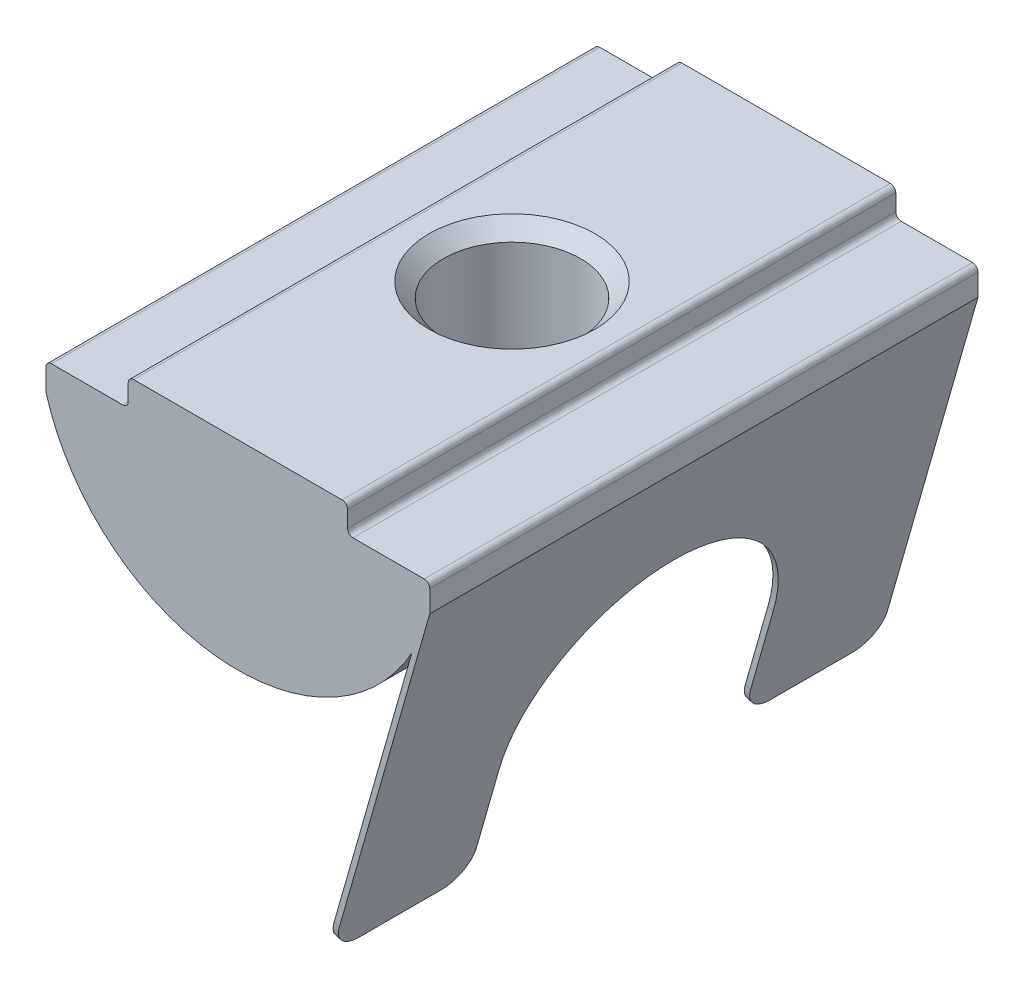
ISO-10303-21;
HEADER;
FILE_DESCRIPTION(('STEP AP214'),'2;1');
FILE_NAME('part.step','',(''),(''),'','','');
FILE_SCHEMA(('AUTOMOTIVE_DESIGN { 1 0 10303 214 1 1 1 1 }'));
ENDSEC;
DATA;
#1=APPLICATION_CONTEXT('core data for automotive mechanical design processes');
#2=APPLICATION_PROTOCOL_DEFINITION('international standard','automotive_design',2000,#1);
#3=PRODUCT_CONTEXT('',#1,'mechanical');
#4=PRODUCT('Part','Part','',(#3));
#5=PRODUCT_RELATED_PRODUCT_CATEGORY('part','',(#4));
#6=PRODUCT_DEFINITION_FORMATION('','',#4);
#7=PRODUCT_DEFINITION_CONTEXT('part definition',#1,'design');
#8=PRODUCT_DEFINITION('design','',#6,#7);
#9=PRODUCT_DEFINITION_SHAPE('','',#8);
#10=(LENGTH_UNIT() NAMED_UNIT(*) SI_UNIT(.MILLI.,.METRE.));
#11=(NAMED_UNIT(*) PLANE_ANGLE_UNIT() SI_UNIT($,.RADIAN.));
#12=(NAMED_UNIT(*) SI_UNIT($,.STERADIAN.) SOLID_ANGLE_UNIT());
#13=UNCERTAINTY_MEASURE_WITH_UNIT(LENGTH_MEASURE(1.E-05),#10,'distance_accuracy_value','');
#14=(GEOMETRIC_REPRESENTATION_CONTEXT(3) GLOBAL_UNCERTAINTY_ASSIGNED_CONTEXT((#13)) GLOBAL_UNIT_ASSIGNED_CONTEXT((#10,
#11,#12)) REPRESENTATION_CONTEXT('',''));
#15=CARTESIAN_POINT('',(0.,0.,0.));
#16=DIRECTION('',(0.,0.,1.));
#17=DIRECTION('',(1.,0.,0.));
#18=AXIS2_PLACEMENT_3D('',#15,#16,#17);
#19=CARTESIAN_POINT('',(3.23632054780592,-14.4448670937512,10.));
#20=DIRECTION('',(0.274721127897363,0.961523947640827,0.));
#21=DIRECTION('',(-0.961523947640827,0.274721127897363,0.));
#22=AXIS2_PLACEMENT_3D('',#19,#20,#21);
#23=PLANE('',#22);
#24=DIRECTION('',(0.,0.,-1.));
#25=VECTOR('',#24,1.);
#26=CARTESIAN_POINT('',(3.23632054780592,-14.4448670937512,10.));
#27=LINE('',#26,#25);
#28=CARTESIAN_POINT('',(3.23632054780592,-14.4448670937512,9.));
#29=VERTEX_POINT('',#28);
#30=CARTESIAN_POINT('',(3.23632054780592,-14.4448670937512,6.));
#31=VERTEX_POINT('',#30);
#32=EDGE_CURVE('E408',#29,#31,#27,.T.);
#33=ORIENTED_EDGE('',*,*,#32,.T.);
#34=DIRECTION('',(0.961523947640827,-0.274721127897363,0.));
#35=VECTOR('',#34,1.);
#36=CARTESIAN_POINT('',(3.23632054780592,-14.4448670937512,6.));
#37=LINE('',#36,#35);
#38=CARTESIAN_POINT('',(3.42862533733408,-14.4998113193307,6.));
#39=VERTEX_POINT('',#38);
#40=EDGE_CURVE('E364',#31,#39,#37,.T.);
#41=ORIENTED_EDGE('',*,*,#40,.T.);
#42=DIRECTION('',(0.,0.,-1.));
#43=VECTOR('',#42,1.);
#44=CARTESIAN_POINT('',(3.42862533733408,-14.4998113193307,10.));
#45=LINE('',#44,#43);
#46=CARTESIAN_POINT('',(3.42862533733408,-14.4998113193307,9.));
#47=VERTEX_POINT('',#46);
#48=EDGE_CURVE('E339',#47,#39,#45,.T.);
#49=ORIENTED_EDGE('',*,*,#48,.F.);
#50=DIRECTION('',(0.961523947640827,-0.274721127897363,0.));
#51=VECTOR('',#50,1.);
#52=CARTESIAN_POINT('',(3.23632054780592,-14.4448670937512,9.));
#53=LINE('',#52,#51);
#54=EDGE_CURVE('E362',#47,#29,#53,.F.);
#55=ORIENTED_EDGE('',*,*,#54,.T.);
#56=EDGE_LOOP('',(#33,#41,#49,#55));
#57=FACE_BOUND('',#56,.T.);
#58=ADVANCED_FACE('F37',(#57),#23,.F.);
#59=CARTESIAN_POINT('',(0.,0.,10.));
#60=DIRECTION('',(0.,0.,-1.));
#61=DIRECTION('',(-1.,0.,0.));
#62=AXIS2_PLACEMENT_3D('',#59,#60,#61);
#63=CYLINDRICAL_SURFACE('',#62,7.28010988928052);
#64=CARTESIAN_POINT('',(0.,-7.28010988928052,2.5));
#65=CARTESIAN_POINT('',(0.136172002973596,-7.28011090721013,2.50000149726712));
#66=CARTESIAN_POINT('',(0.272333456245304,-7.27625452620177,2.48883840329551));
#67=CARTESIAN_POINT('',(0.540631700282913,-7.26125171305419,2.44462768603801));
#68=CARTESIAN_POINT('',(0.672768314267703,-7.25010496118531,2.41157910293182));
#69=CARTESIAN_POINT('',(0.929110265104461,-7.22172923500482,2.32487368836761));
#70=CARTESIAN_POINT('',(1.05332891173866,-7.20451080331503,2.27125256413121));
#71=CARTESIAN_POINT('',(1.29100805538926,-7.16573916649586,2.1450902881722));
#72=CARTESIAN_POINT('',(1.40446622533751,-7.14418502685445,2.07254505657347));
#73=CARTESIAN_POINT('',(1.62154369249124,-7.09812088144492,1.90781716695809));
#74=CARTESIAN_POINT('',(1.72471659510491,-7.07353696810219,1.81506705800555));
#75=CARTESIAN_POINT('',(1.91438900072752,-7.02458029881306,1.61376808900686));
#76=CARTESIAN_POINT('',(2.00088452396937,-7.00020759459,1.50521546878509));
#77=CARTESIAN_POINT('',(2.15736096271624,-6.95360914951797,1.27129533030878));
#78=CARTESIAN_POINT('',(2.22675004681145,-6.93147284455898,1.1455123677416));
#79=CARTESIAN_POINT('',(2.3431963166986,-6.89298339231084,0.883179389448171));
#80=CARTESIAN_POINT('',(2.39026079713456,-6.87662835641702,0.746632907770805));
#81=CARTESIAN_POINT('',(2.45902666162184,-6.85233416396837,0.471742033480053));
#82=CARTESIAN_POINT('',(2.48156840718877,-6.84411709080833,0.33363317622437));
#83=CARTESIAN_POINT('',(2.50327644929663,-6.83620899259231,0.055367808356121));
#84=CARTESIAN_POINT('',(2.50245050194682,-6.8365151385437,-0.0847880074008335));
#85=CARTESIAN_POINT('',(2.47809674095438,-6.84537623905281,-0.355886800083905));
#86=CARTESIAN_POINT('',(2.45568077995558,-6.85352718334113,-0.486945190886543));
#87=CARTESIAN_POINT('',(2.3906027224079,-6.87649598693466,-0.743313406426924));
#88=CARTESIAN_POINT('',(2.34793806176709,-6.89131469056559,-0.868622500927038));
#89=CARTESIAN_POINT('',(2.24287391373931,-6.92622653995014,-1.11240008806434));
#90=CARTESIAN_POINT('',(2.18015471461307,-6.94640416827135,-1.23071816553836));
#91=CARTESIAN_POINT('',(2.03698389740605,-6.98972664055986,-1.45549514204004));
#92=CARTESIAN_POINT('',(1.95652691007652,-7.01287238208906,-1.56195043546876));
#93=CARTESIAN_POINT('',(1.77488315359577,-7.06109659600814,-1.76620717458573));
#94=CARTESIAN_POINT('',(1.67279218109922,-7.08621095740278,-1.86319776756405));
#95=CARTESIAN_POINT('',(1.45348844221079,-7.1344208661539,-2.03890031738033));
#96=CARTESIAN_POINT('',(1.33627404413953,-7.15751619522353,-2.11761029933795));
#97=CARTESIAN_POINT('',(1.08825090515884,-7.19942220387474,-2.25522413641818));
#98=CARTESIAN_POINT('',(0.957305787037685,-7.21818251231304,-2.31389859861828));
#99=CARTESIAN_POINT('',(0.686603674720866,-7.24893750906168,-2.40813080567592));
#100=CARTESIAN_POINT('',(0.546849958632755,-7.26093469792176,-2.44369709513474));
#101=CARTESIAN_POINT('',(0.269352973257202,-7.27639154772063,-2.48923870288672));
#102=CARTESIAN_POINT('',(0.131809470218108,-7.28021615822202,-2.50030876998938));
#103=CARTESIAN_POINT('',(-0.143204820098718,-7.27999916127158,-2.49967824487058));
#104=CARTESIAN_POINT('',(-0.280675616023345,-7.27595897453731,-2.48798176525776));
#105=CARTESIAN_POINT('',(-0.547180073947,-7.2607074679308,-2.44300925946856));
#106=CARTESIAN_POINT('',(-0.676343168003689,-7.24972305694643,-2.41041560684431));
#107=CARTESIAN_POINT('',(-0.927307313384241,-7.22191489938522,-2.32543755128986));
#108=CARTESIAN_POINT('',(-1.04910741417951,-7.20509040076205,-2.27305059943778));
#109=CARTESIAN_POINT('',(-1.28557880503337,-7.16673102834509,-2.14840314911509));
#110=CARTESIAN_POINT('',(-1.39996673893285,-7.14508066202505,-2.07564166556157));
#111=CARTESIAN_POINT('',(-1.61525922158065,-7.09951173020316,-1.91289345581315));
#112=CARTESIAN_POINT('',(-1.71615941608667,-7.07559243646424,-1.82290118970669));
#113=CARTESIAN_POINT('',(-1.90669766963834,-7.0267098274581,-1.62310353054673));
#114=CARTESIAN_POINT('',(-1.99555492718474,-7.0017519746124,-1.51255033804574));
#115=CARTESIAN_POINT('',(-2.15356634580185,-6.95478028320132,-1.27757379215295));
#116=CARTESIAN_POINT('',(-2.22272004110768,-6.93276651423653,-1.15315011097875));
#117=CARTESIAN_POINT('',(-2.33911288913602,-6.89436913565234,-0.893720756387379));
#118=CARTESIAN_POINT('',(-2.38637074740113,-6.87798072342277,-0.758724231020516));
#119=CARTESIAN_POINT('',(-2.45724666416524,-6.8529832027846,-0.481989431069247));
#120=CARTESIAN_POINT('',(-2.48087624926812,-6.8443703014403,-0.340254479083618));
#121=CARTESIAN_POINT('',(-2.5028928364975,-6.83634776676673,-0.0623689276409462));
#122=CARTESIAN_POINT('',(-2.50258379138015,-6.83646271469208,0.0736657186451755));
#123=CARTESIAN_POINT('',(-2.47997178682332,-6.8446973205737,0.34363502483685));
#124=CARTESIAN_POINT('',(-2.45767029483372,-6.85281644444991,0.477569824249305));
#125=CARTESIAN_POINT('',(-2.39265272519977,-6.87578028279747,0.736668394410245));
#126=CARTESIAN_POINT('',(-2.35038401512852,-6.89047725797267,0.861958568502402));
#127=CARTESIAN_POINT('',(-2.24700077680345,-6.92487844061245,1.10376091286428));
#128=CARTESIAN_POINT('',(-2.18588191024345,-6.94458380055771,1.22027105474743));
#129=CARTESIAN_POINT('',(-2.04327052166701,-6.987906262972,1.44699452591958));
#130=CARTESIAN_POINT('',(-1.96097301358844,-7.01166119962184,1.55667497524559));
#131=CARTESIAN_POINT('',(-1.77967402768589,-7.05985469974412,1.76108928969529));
#132=CARTESIAN_POINT('',(-1.68066769184339,-7.08429346030656,1.85581879235105));
#133=CARTESIAN_POINT('',(-1.46373542493737,-7.13234286442047,2.03169477908898));
#134=CARTESIAN_POINT('',(-1.34518614307746,-7.15587469483244,2.11209678707906));
#135=CARTESIAN_POINT('',(-1.09546530503834,-7.19833097882213,2.25175707308962));
#136=CARTESIAN_POINT('',(-0.964296060895373,-7.21725627410456,2.31101921470266));
#137=CARTESIAN_POINT('',(-0.696314583988972,-7.24795661957034,2.40516408221482));
#138=CARTESIAN_POINT('',(-0.55971879433403,-7.25989520997863,2.44060756240863));
#139=CARTESIAN_POINT('',(-0.282077271459753,-7.27597006877919,2.48802098850037));
#140=CARTESIAN_POINT('',(-0.141032977561192,-7.28010883501355,2.49999844928446));
#141=CARTESIAN_POINT('',(0.,-7.28010988928052,2.5));
#142=B_SPLINE_CURVE_WITH_KNOTS('',3,(#64,#65,#66,#67,#68,#69,#70,#71,#72,#73,#74,#75,#76,#77,
#78,#79,#80,#81,#82,#83,#84,#85,#86,#87,#88,#89,#90,#91,#92,#93,#94,#95,#96,#97,#98,#99,#100,
#101,#102,#103,#104,#105,#106,#107,#108,#109,#110,#111,#112,#113,#114,#115,#116,#117,#118,#119,
#120,#121,#122,#123,#124,#125,#126,#127,#128,#129,#130,#131,#132,#133,#134,#135,#136,#137,#138,
#139,#140,#141),.UNSPECIFIED.,.T.,.F.,(4,2,2,2,2,2,2,2,2,2,2,2,2,2,2,2,2,2,2,2,2,2,2,2,2,2,2,2,
2,2,2,2,2,2,2,2,2,2,4),(0.,0.407996722313559,0.816011339108413,1.22332095614636,
1.63071845834191,2.05151668779853,2.47241520950502,2.90629914452054,3.34004120858136,
3.75839951900427,4.17661897127397,4.57439196465527,4.97221534145776,5.37672667953705,
5.78136063219424,6.20850421951139,6.63569393031439,7.06762241551642,7.49939109750493,
7.91143720286904,8.32340888205313,8.72256941101795,9.12178136021138,9.53183270839227,
9.94201611524967,10.3720397066067,10.802073462282,11.2317391610397,11.6611951531473,
12.0672757691849,12.4733292912552,12.8706879047601,13.2681380374699,13.6837934850717,
14.0995699915327,14.5329418493526,14.9662344620558,15.3889309597712,15.8114920687111),.UNSPECIFIED.);
#143=CARTESIAN_POINT('',(0.,-7.28010988928052,2.5));
#144=VERTEX_POINT('',#143);
#145=EDGE_CURVE('E273',#144,#144,#142,.T.);
#146=ORIENTED_EDGE('',*,*,#145,.T.);
#147=EDGE_LOOP('',(#146));
#148=FACE_BOUND('',#147,.T.);
#149=DIRECTION('',(0.,0.,-1.));
#150=VECTOR('',#149,1.);
#151=CARTESIAN_POINT('',(6.3421224080087,-3.57456058304149,10.));
#152=LINE('',#151,#150);
#153=CARTESIAN_POINT('',(6.3421224080087,-3.57456058304149,10.));
#154=VERTEX_POINT('',#153);
#155=CARTESIAN_POINT('',(6.3421224080087,-3.57456058304149,-10.));
#156=VERTEX_POINT('',#155);
#157=EDGE_CURVE('E410',#154,#156,#152,.T.);
#158=ORIENTED_EDGE('',*,*,#157,.F.);
#159=CARTESIAN_POINT('',(0.,0.,10.));
#160=DIRECTION('',(0.,0.,1.));
#161=DIRECTION('',(1.,0.,0.));
#162=AXIS2_PLACEMENT_3D('',#159,#160,#161);
#163=CIRCLE('',#162,7.28010988928052);
#164=CARTESIAN_POINT('',(-7.,-2.,10.));
#165=VERTEX_POINT('',#164);
#166=EDGE_CURVE('E238',#165,#154,#163,.T.);
#167=ORIENTED_EDGE('',*,*,#166,.F.);
#168=DIRECTION('',(0.,0.,-1.));
#169=VECTOR('',#168,1.);
#170=CARTESIAN_POINT('',(-7.,-2.,10.));
#171=LINE('',#170,#169);
#172=CARTESIAN_POINT('',(-7.,-2.,-10.));
#173=VERTEX_POINT('',#172);
#174=EDGE_CURVE('E232',#165,#173,#171,.T.);
#175=ORIENTED_EDGE('',*,*,#174,.T.);
#176=CARTESIAN_POINT('',(0.,0.,-10.));
#177=DIRECTION('',(0.,0.,1.));
#178=DIRECTION('',(1.,0.,0.));
#179=AXIS2_PLACEMENT_3D('',#176,#177,#178);
#180=CIRCLE('',#179,7.28010988928052);
#181=EDGE_CURVE('E262',#173,#156,#180,.T.);
#182=ORIENTED_EDGE('',*,*,#181,.T.);
#183=EDGE_LOOP('',(#158,#167,#175,#182));
#184=FACE_BOUND('',#183,.T.);
#185=ADVANCED_FACE('F283',(#148,#184),#63,.T.);
#186=CARTESIAN_POINT('',(4.,-0.999999999999999,10.));
#187=DIRECTION('',(-1.,0.,0.));
#188=DIRECTION('',(0.,0.,1.));
#189=AXIS2_PLACEMENT_3D('',#186,#187,#188);
#190=PLANE('',#189);
#191=DIRECTION('',(0.,1.,0.));
#192=VECTOR('',#191,1.);
#193=CARTESIAN_POINT('',(4.,-0.999999999999999,10.));
#194=LINE('',#193,#192);
#195=CARTESIAN_POINT('',(4.,-0.799999999999999,10.));
#196=VERTEX_POINT('',#195);
#197=CARTESIAN_POINT('',(4.,-0.2,10.));
#198=VERTEX_POINT('',#197);
#199=EDGE_CURVE('E269',#196,#198,#194,.T.);
#200=ORIENTED_EDGE('',*,*,#199,.F.);
#201=DIRECTION('',(0.,0.,-1.));
#202=VECTOR('',#201,1.);
#203=CARTESIAN_POINT('',(4.,-0.799999999999999,-10.));
#204=LINE('',#203,#202);
#205=CARTESIAN_POINT('',(4.,-0.799999999999999,-10.));
#206=VERTEX_POINT('',#205);
#207=EDGE_CURVE('E488',#196,#206,#204,.T.);
#208=ORIENTED_EDGE('',*,*,#207,.T.);
#209=DIRECTION('',(0.,1.,0.));
#210=VECTOR('',#209,1.);
#211=CARTESIAN_POINT('',(4.,-0.999999999999999,-10.));
#212=LINE('',#211,#210);
#213=CARTESIAN_POINT('',(4.,-0.2,-10.));
#214=VERTEX_POINT('',#213);
#215=EDGE_CURVE('E247',#206,#214,#212,.T.);
#216=ORIENTED_EDGE('',*,*,#215,.T.);
#217=DIRECTION('',(0.,0.,-1.));
#218=VECTOR('',#217,1.);
#219=CARTESIAN_POINT('',(4.,-0.2,10.));
#220=LINE('',#219,#218);
#221=EDGE_CURVE('E491',#214,#198,#220,.F.);
#222=ORIENTED_EDGE('',*,*,#221,.T.);
#223=EDGE_LOOP('',(#200,#208,#216,#222));
#224=FACE_BOUND('',#223,.T.);
#225=ADVANCED_FACE('F318',(#224),#190,.F.);
#226=CARTESIAN_POINT('',(-4.,0.,10.));
#227=DIRECTION('',(0.,-1.,0.));
#228=DIRECTION('',(0.,0.,-1.));
#229=AXIS2_PLACEMENT_3D('',#226,#227,#228);
#230=PLANE('',#229);
#231=CARTESIAN_POINT('',(0.,0.,0.));
#232=DIRECTION('',(0.,1.,0.));
#233=DIRECTION('',(0.,0.,1.));
#234=AXIS2_PLACEMENT_3D('',#231,#232,#233);
#235=CIRCLE('',#234,3.025);
#236=CARTESIAN_POINT('',(0.,0.,3.025));
#237=VERTEX_POINT('',#236);
#238=EDGE_CURVE('E413',#237,#237,#235,.T.);
#239=ORIENTED_EDGE('',*,*,#238,.F.);
#240=EDGE_LOOP('',(#239));
#241=FACE_BOUND('',#240,.T.);
#242=DIRECTION('',(-1.,0.,0.));
#243=VECTOR('',#242,1.);
#244=CARTESIAN_POINT('',(-4.,0.,10.));
#245=LINE('',#244,#243);
#246=CARTESIAN_POINT('',(3.8,0.,10.));
#247=VERTEX_POINT('',#246);
#248=CARTESIAN_POINT('',(-3.8,0.,10.));
#249=VERTEX_POINT('',#248);
#250=EDGE_CURVE('E420',#247,#249,#245,.T.);
#251=ORIENTED_EDGE('',*,*,#250,.F.);
#252=DIRECTION('',(0.,0.,-1.));
#253=VECTOR('',#252,1.);
#254=CARTESIAN_POINT('',(3.8,0.,10.));
#255=LINE('',#254,#253);
#256=CARTESIAN_POINT('',(3.8,0.,-10.));
#257=VERTEX_POINT('',#256);
#258=EDGE_CURVE('E483',#247,#257,#255,.T.);
#259=ORIENTED_EDGE('',*,*,#258,.T.);
#260=DIRECTION('',(-1.,0.,0.));
#261=VECTOR('',#260,1.);
#262=CARTESIAN_POINT('',(-4.,0.,-10.));
#263=LINE('',#262,#261);
#264=CARTESIAN_POINT('',(-3.8,0.,-10.));
#265=VERTEX_POINT('',#264);
#266=EDGE_CURVE('E250',#257,#265,#263,.T.);
#267=ORIENTED_EDGE('',*,*,#266,.T.);
#268=DIRECTION('',(0.,0.,-1.));
#269=VECTOR('',#268,1.);
#270=CARTESIAN_POINT('',(-3.8,0.,10.));
#271=LINE('',#270,#269);
#272=EDGE_CURVE('E486',#265,#249,#271,.F.);
#273=ORIENTED_EDGE('',*,*,#272,.T.);
#274=EDGE_LOOP('',(#251,#259,#267,#273));
#275=FACE_BOUND('',#274,.T.);
#276=ADVANCED_FACE('F529',(#241,#275),#230,.F.);
#277=CARTESIAN_POINT('',(-4.,0.,10.));
#278=DIRECTION('',(1.,0.,0.));
#279=DIRECTION('',(0.,0.,-1.));
#280=AXIS2_PLACEMENT_3D('',#277,#278,#279);
#281=PLANE('',#280);
#282=DIRECTION('',(0.,-1.,0.));
#283=VECTOR('',#282,1.);
#284=CARTESIAN_POINT('',(-4.,0.,-10.));
#285=LINE('',#284,#283);
#286=CARTESIAN_POINT('',(-4.,-0.2,-10.));
#287=VERTEX_POINT('',#286);
#288=CARTESIAN_POINT('',(-4.,-0.8,-10.));
#289=VERTEX_POINT('',#288);
#290=EDGE_CURVE('E254',#287,#289,#285,.T.);
#291=ORIENTED_EDGE('',*,*,#290,.T.);
#292=DIRECTION('',(0.,0.,-1.));
#293=VECTOR('',#292,1.);
#294=CARTESIAN_POINT('',(-4.,-0.8,10.));
#295=LINE('',#294,#293);
#296=CARTESIAN_POINT('',(-4.,-0.8,10.));
#297=VERTEX_POINT('',#296);
#298=EDGE_CURVE('E471',#289,#297,#295,.F.);
#299=ORIENTED_EDGE('',*,*,#298,.T.);
#300=DIRECTION('',(0.,-1.,0.));
#301=VECTOR('',#300,1.);
#302=CARTESIAN_POINT('',(-4.,0.,10.));
#303=LINE('',#302,#301);
#304=CARTESIAN_POINT('',(-4.,-0.2,10.));
#305=VERTEX_POINT('',#304);
#306=EDGE_CURVE('E423',#305,#297,#303,.T.);
#307=ORIENTED_EDGE('',*,*,#306,.F.);
#308=DIRECTION('',(0.,0.,-1.));
#309=VECTOR('',#308,1.);
#310=CARTESIAN_POINT('',(-4.,-0.2,10.));
#311=LINE('',#310,#309);
#312=EDGE_CURVE('E473',#305,#287,#311,.T.);
#313=ORIENTED_EDGE('',*,*,#312,.T.);
#314=EDGE_LOOP('',(#291,#299,#307,#313));
#315=FACE_BOUND('',#314,.T.);
#316=ADVANCED_FACE('F538',(#315),#281,.F.);
#317=CARTESIAN_POINT('',(-4.,-1.,10.));
#318=DIRECTION('',(0.,-1.,0.));
#319=DIRECTION('',(1.,0.,0.));
#320=AXIS2_PLACEMENT_3D('',#317,#318,#319);
#321=PLANE('',#320);
#322=DIRECTION('',(-1.,0.,0.));
#323=VECTOR('',#322,1.);
#324=CARTESIAN_POINT('',(-4.,-1.,-10.));
#325=LINE('',#324,#323);
#326=CARTESIAN_POINT('',(-4.2,-1.,-10.));
#327=VERTEX_POINT('',#326);
#328=CARTESIAN_POINT('',(-6.8,-1.,-10.));
#329=VERTEX_POINT('',#328);
#330=EDGE_CURVE('E257',#327,#329,#325,.T.);
#331=ORIENTED_EDGE('',*,*,#330,.T.);
#332=DIRECTION('',(0.,0.,-1.));
#333=VECTOR('',#332,1.);
#334=CARTESIAN_POINT('',(-6.8,-1.,10.));
#335=LINE('',#334,#333);
#336=CARTESIAN_POINT('',(-6.8,-1.,10.));
#337=VERTEX_POINT('',#336);
#338=EDGE_CURVE('E476',#329,#337,#335,.F.);
#339=ORIENTED_EDGE('',*,*,#338,.T.);
#340=DIRECTION('',(-1.,0.,0.));
#341=VECTOR('',#340,1.);
#342=CARTESIAN_POINT('',(-4.,-1.,10.));
#343=LINE('',#342,#341);
#344=CARTESIAN_POINT('',(-4.2,-1.,10.));
#345=VERTEX_POINT('',#344);
#346=EDGE_CURVE('E426',#345,#337,#343,.T.);
#347=ORIENTED_EDGE('',*,*,#346,.F.);
#348=DIRECTION('',(0.,0.,-1.));
#349=VECTOR('',#348,1.);
#350=CARTESIAN_POINT('',(-4.2,-1.,-10.));
#351=LINE('',#350,#349);
#352=EDGE_CURVE('E478',#345,#327,#351,.T.);
#353=ORIENTED_EDGE('',*,*,#352,.T.);
#354=EDGE_LOOP('',(#331,#339,#347,#353));
#355=FACE_BOUND('',#354,.T.);
#356=ADVANCED_FACE('F309',(#355),#321,.F.);
#357=CARTESIAN_POINT('',(-7.,-1.,10.));
#358=DIRECTION('',(1.,0.,0.));
#359=DIRECTION('',(0.,1.,0.));
#360=AXIS2_PLACEMENT_3D('',#357,#358,#359);
#361=PLANE('',#360);
#362=DIRECTION('',(0.,-1.,0.));
#363=VECTOR('',#362,1.);
#364=CARTESIAN_POINT('',(-7.,-1.,10.));
#365=LINE('',#364,#363);
#366=CARTESIAN_POINT('',(-7.,-1.2,10.));
#367=VERTEX_POINT('',#366);
#368=EDGE_CURVE('E243',#367,#165,#365,.T.);
#369=ORIENTED_EDGE('',*,*,#368,.F.);
#370=DIRECTION('',(0.,0.,-1.));
#371=VECTOR('',#370,1.);
#372=CARTESIAN_POINT('',(-7.,-1.2,10.));
#373=LINE('',#372,#371);
#374=CARTESIAN_POINT('',(-7.,-1.2,-10.));
#375=VERTEX_POINT('',#374);
#376=EDGE_CURVE('E481',#367,#375,#373,.T.);
#377=ORIENTED_EDGE('',*,*,#376,.T.);
#378=DIRECTION('',(0.,-1.,0.));
#379=VECTOR('',#378,1.);
#380=CARTESIAN_POINT('',(-7.,-1.,-10.));
#381=LINE('',#380,#379);
#382=EDGE_CURVE('E260',#375,#173,#381,.T.);
#383=ORIENTED_EDGE('',*,*,#382,.T.);
#384=ORIENTED_EDGE('',*,*,#174,.F.);
#385=EDGE_LOOP('',(#369,#377,#383,#384));
#386=FACE_BOUND('',#385,.T.);
#387=ADVANCED_FACE('F305',(#386),#361,.F.);
#388=CARTESIAN_POINT('',(7.,-0.999999999999999,10.));
#389=DIRECTION('',(-1.,0.,0.));
#390=DIRECTION('',(0.,0.,1.));
#391=AXIS2_PLACEMENT_3D('',#388,#389,#390);
#392=PLANE('',#391);
#393=DIRECTION('',(0.,1.,0.));
#394=VECTOR('',#393,1.);
#395=CARTESIAN_POINT('',(7.,-0.999999999999999,-10.));
#396=LINE('',#395,#394);
#397=CARTESIAN_POINT('',(7.,-2.,-10.));
#398=VERTEX_POINT('',#397);
#399=CARTESIAN_POINT('',(7.,-1.2,-10.));
#400=VERTEX_POINT('',#399);
#401=EDGE_CURVE('E265',#398,#400,#396,.T.);
#402=ORIENTED_EDGE('',*,*,#401,.T.);
#403=DIRECTION('',(0.,0.,-1.));
#404=VECTOR('',#403,1.);
#405=CARTESIAN_POINT('',(7.,-1.2,10.));
#406=LINE('',#405,#404);
#407=CARTESIAN_POINT('',(7.,-1.2,10.));
#408=VERTEX_POINT('',#407);
#409=EDGE_CURVE('E237',#400,#408,#406,.F.);
#410=ORIENTED_EDGE('',*,*,#409,.T.);
#411=DIRECTION('',(0.,1.,0.));
#412=VECTOR('',#411,1.);
#413=CARTESIAN_POINT('',(7.,-0.999999999999999,10.));
#414=LINE('',#413,#412);
#415=CARTESIAN_POINT('',(7.,-2.,10.));
#416=VERTEX_POINT('',#415);
#417=EDGE_CURVE('E216',#416,#408,#414,.T.);
#418=ORIENTED_EDGE('',*,*,#417,.F.);
#419=DIRECTION('',(0.,0.,-1.));
#420=VECTOR('',#419,1.);
#421=CARTESIAN_POINT('',(7.,-2.,10.));
#422=LINE('',#421,#420);
#423=EDGE_CURVE('E224',#416,#398,#422,.T.);
#424=ORIENTED_EDGE('',*,*,#423,.T.);
#425=EDGE_LOOP('',(#402,#410,#418,#424));
#426=FACE_BOUND('',#425,.T.);
#427=ADVANCED_FACE('F235',(#426),#392,.F.);
#428=CARTESIAN_POINT('',(4.,-0.999999999999999,10.));
#429=DIRECTION('',(0.,-1.,0.));
#430=DIRECTION('',(1.,0.,0.));
#431=AXIS2_PLACEMENT_3D('',#428,#429,#430);
#432=PLANE('',#431);
#433=DIRECTION('',(-1.,0.,0.));
#434=VECTOR('',#433,1.);
#435=CARTESIAN_POINT('',(4.,-0.999999999999999,10.));
#436=LINE('',#435,#434);
#437=CARTESIAN_POINT('',(6.8,-0.999999999999999,10.));
#438=VERTEX_POINT('',#437);
#439=CARTESIAN_POINT('',(4.2,-0.999999999999999,10.));
#440=VERTEX_POINT('',#439);
#441=EDGE_CURVE('E233',#438,#440,#436,.T.);
#442=ORIENTED_EDGE('',*,*,#441,.F.);
#443=DIRECTION('',(0.,0.,-1.));
#444=VECTOR('',#443,1.);
#445=CARTESIAN_POINT('',(6.8,-0.999999999999999,10.));
#446=LINE('',#445,#444);
#447=CARTESIAN_POINT('',(6.8,-0.999999999999999,-10.));
#448=VERTEX_POINT('',#447);
#449=EDGE_CURVE('E508',#438,#448,#446,.T.);
#450=ORIENTED_EDGE('',*,*,#449,.T.);
#451=DIRECTION('',(-1.,0.,0.));
#452=VECTOR('',#451,1.);
#453=CARTESIAN_POINT('',(4.,-0.999999999999999,-10.));
#454=LINE('',#453,#452);
#455=CARTESIAN_POINT('',(4.2,-0.999999999999999,-10.));
#456=VERTEX_POINT('',#455);
#457=EDGE_CURVE('E267',#448,#456,#454,.T.);
#458=ORIENTED_EDGE('',*,*,#457,.T.);
#459=DIRECTION('',(0.,0.,-1.));
#460=VECTOR('',#459,1.);
#461=CARTESIAN_POINT('',(4.2,-0.999999999999999,10.));
#462=LINE('',#461,#460);
#463=EDGE_CURVE('E281',#456,#440,#462,.F.);
#464=ORIENTED_EDGE('',*,*,#463,.T.);
#465=EDGE_LOOP('',(#442,#450,#458,#464));
#466=FACE_BOUND('',#465,.T.);
#467=ADVANCED_FACE('F298',(#466),#432,.F.);
#468=CARTESIAN_POINT('',(0.,0.,10.));
#469=DIRECTION('',(0.,0.,1.));
#470=DIRECTION('',(1.,0.,0.));
#471=AXIS2_PLACEMENT_3D('',#468,#469,#470);
#472=PLANE('',#471);
#473=DIRECTION('',(-0.274721127897378,-0.961523947640823,0.));
#474=VECTOR('',#473,1.);
#475=CARTESIAN_POINT('',(6.80769521047183,-1.94505577442053,10.));
#476=LINE('',#475,#474);
#477=CARTESIAN_POINT('',(3.51104167570329,-13.4833431461104,10.));
#478=VERTEX_POINT('',#477);
#479=EDGE_CURVE('E221',#154,#478,#476,.T.);
#480=ORIENTED_EDGE('',*,*,#479,.T.);
#481=DIRECTION('',(0.961523947640827,-0.274721127897363,0.));
#482=VECTOR('',#481,1.);
#483=CARTESIAN_POINT('',(3.70334646523145,-13.5382873716899,10.));
#484=LINE('',#483,#482);
#485=CARTESIAN_POINT('',(3.70334646523146,-13.5382873716899,10.));
#486=VERTEX_POINT('',#485);
#487=EDGE_CURVE('E219',#478,#486,#484,.T.);
#488=ORIENTED_EDGE('',*,*,#487,.T.);
#489=DIRECTION('',(0.274721127897378,0.961523947640823,0.));
#490=VECTOR('',#489,1.);
#491=CARTESIAN_POINT('',(7.,-2.,10.));
#492=LINE('',#491,#490);
#493=EDGE_CURVE('E211',#486,#416,#492,.T.);
#494=ORIENTED_EDGE('',*,*,#493,.T.);
#495=ORIENTED_EDGE('',*,*,#417,.T.);
#496=CARTESIAN_POINT('',(6.8,-1.2,10.));
#497=DIRECTION('',(0.,0.,1.));
#498=DIRECTION('',(1.,0.,0.));
#499=AXIS2_PLACEMENT_3D('',#496,#497,#498);
#500=CIRCLE('',#499,0.2);
#501=EDGE_CURVE('E493',#408,#438,#500,.T.);
#502=ORIENTED_EDGE('',*,*,#501,.T.);
#503=ORIENTED_EDGE('',*,*,#441,.T.);
#504=CARTESIAN_POINT('',(4.2,-0.799999999999999,10.));
#505=DIRECTION('',(0.,0.,1.));
#506=DIRECTION('',(1.,0.,0.));
#507=AXIS2_PLACEMENT_3D('',#504,#505,#506);
#508=CIRCLE('',#507,0.2);
#509=EDGE_CURVE('E467',#440,#196,#508,.F.);
#510=ORIENTED_EDGE('',*,*,#509,.T.);
#511=ORIENTED_EDGE('',*,*,#199,.T.);
#512=CARTESIAN_POINT('',(3.8,-0.2,10.));
#513=DIRECTION('',(0.,0.,1.));
#514=DIRECTION('',(1.,0.,0.));
#515=AXIS2_PLACEMENT_3D('',#512,#513,#514);
#516=CIRCLE('',#515,0.2);
#517=EDGE_CURVE('E495',#198,#247,#516,.T.);
#518=ORIENTED_EDGE('',*,*,#517,.T.);
#519=ORIENTED_EDGE('',*,*,#250,.T.);
#520=CARTESIAN_POINT('',(-3.8,-0.2,10.));
#521=DIRECTION('',(0.,0.,1.));
#522=DIRECTION('',(1.,0.,0.));
#523=AXIS2_PLACEMENT_3D('',#520,#521,#522);
#524=CIRCLE('',#523,0.2);
#525=EDGE_CURVE('E498',#249,#305,#524,.T.);
#526=ORIENTED_EDGE('',*,*,#525,.T.);
#527=ORIENTED_EDGE('',*,*,#306,.T.);
#528=CARTESIAN_POINT('',(-4.2,-0.8,10.));
#529=DIRECTION('',(0.,0.,1.));
#530=DIRECTION('',(1.,0.,0.));
#531=AXIS2_PLACEMENT_3D('',#528,#529,#530);
#532=CIRCLE('',#531,0.2);
#533=EDGE_CURVE('E463',#297,#345,#532,.F.);
#534=ORIENTED_EDGE('',*,*,#533,.T.);
#535=ORIENTED_EDGE('',*,*,#346,.T.);
#536=CARTESIAN_POINT('',(-6.8,-1.2,10.));
#537=DIRECTION('',(0.,0.,1.));
#538=DIRECTION('',(1.,0.,0.));
#539=AXIS2_PLACEMENT_3D('',#536,#537,#538);
#540=CIRCLE('',#539,0.2);
#541=EDGE_CURVE('E432',#337,#367,#540,.T.);
#542=ORIENTED_EDGE('',*,*,#541,.T.);
#543=ORIENTED_EDGE('',*,*,#368,.T.);
#544=ORIENTED_EDGE('',*,*,#166,.T.);
#545=EDGE_LOOP('',(#480,#488,#494,#495,#502,#503,#510,#511,#518,#519,#526,#527,#534,#535,#542,
#543,#544));
#546=FACE_BOUND('',#545,.T.);
#547=ADVANCED_FACE('F214',(#546),#472,.T.);
#548=CARTESIAN_POINT('',(0.,0.,-10.));
#549=DIRECTION('',(0.,0.,1.));
#550=DIRECTION('',(1.,0.,0.));
#551=AXIS2_PLACEMENT_3D('',#548,#549,#550);
#552=PLANE('',#551);
#553=DIRECTION('',(0.274721127897378,0.961523947640823,0.));
#554=VECTOR('',#553,1.);
#555=CARTESIAN_POINT('',(7.,-2.,-10.));
#556=LINE('',#555,#554);
#557=CARTESIAN_POINT('',(3.70334646523146,-13.5382873716899,-10.));
#558=VERTEX_POINT('',#557);
#559=EDGE_CURVE('E228',#558,#398,#556,.T.);
#560=ORIENTED_EDGE('',*,*,#559,.F.);
#561=DIRECTION('',(0.961523947640827,-0.274721127897363,0.));
#562=VECTOR('',#561,1.);
#563=CARTESIAN_POINT('',(-3.29665353476839,-11.53828737169,-10.));
#564=LINE('',#563,#562);
#565=CARTESIAN_POINT('',(3.51104167570329,-13.4833431461104,-10.));
#566=VERTEX_POINT('',#565);
#567=EDGE_CURVE('E360',#558,#566,#564,.F.);
#568=ORIENTED_EDGE('',*,*,#567,.T.);
#569=DIRECTION('',(-0.274721127897378,-0.961523947640823,0.));
#570=VECTOR('',#569,1.);
#571=CARTESIAN_POINT('',(6.80769521047183,-1.94505577442053,-10.));
#572=LINE('',#571,#570);
#573=EDGE_CURVE('E386',#156,#566,#572,.T.);
#574=ORIENTED_EDGE('',*,*,#573,.F.);
#575=ORIENTED_EDGE('',*,*,#181,.F.);
#576=ORIENTED_EDGE('',*,*,#382,.F.);
#577=CARTESIAN_POINT('',(-6.8,-1.2,-10.));
#578=DIRECTION('',(0.,0.,1.));
#579=DIRECTION('',(1.,0.,0.));
#580=AXIS2_PLACEMENT_3D('',#577,#578,#579);
#581=CIRCLE('',#580,0.2);
#582=EDGE_CURVE('E505',#375,#329,#581,.F.);
#583=ORIENTED_EDGE('',*,*,#582,.T.);
#584=ORIENTED_EDGE('',*,*,#330,.F.);
#585=CARTESIAN_POINT('',(-4.2,-0.8,-10.));
#586=DIRECTION('',(0.,0.,1.));
#587=DIRECTION('',(1.,0.,0.));
#588=AXIS2_PLACEMENT_3D('',#585,#586,#587);
#589=CIRCLE('',#588,0.2);
#590=EDGE_CURVE('E465',#327,#289,#589,.T.);
#591=ORIENTED_EDGE('',*,*,#590,.T.);
#592=ORIENTED_EDGE('',*,*,#290,.F.);
#593=CARTESIAN_POINT('',(-3.8,-0.2,-10.));
#594=DIRECTION('',(0.,0.,1.));
#595=DIRECTION('',(1.,0.,0.));
#596=AXIS2_PLACEMENT_3D('',#593,#594,#595);
#597=CIRCLE('',#596,0.2);
#598=EDGE_CURVE('E507',#287,#265,#597,.F.);
#599=ORIENTED_EDGE('',*,*,#598,.T.);
#600=ORIENTED_EDGE('',*,*,#266,.F.);
#601=CARTESIAN_POINT('',(3.8,-0.2,-10.));
#602=DIRECTION('',(0.,0.,1.));
#603=DIRECTION('',(1.,0.,0.));
#604=AXIS2_PLACEMENT_3D('',#601,#602,#603);
#605=CIRCLE('',#604,0.2);
#606=EDGE_CURVE('E503',#257,#214,#605,.F.);
#607=ORIENTED_EDGE('',*,*,#606,.T.);
#608=ORIENTED_EDGE('',*,*,#215,.F.);
#609=CARTESIAN_POINT('',(4.2,-0.799999999999999,-10.));
#610=DIRECTION('',(0.,0.,1.));
#611=DIRECTION('',(1.,0.,0.));
#612=AXIS2_PLACEMENT_3D('',#609,#610,#611);
#613=CIRCLE('',#612,0.2);
#614=EDGE_CURVE('E469',#206,#456,#613,.T.);
#615=ORIENTED_EDGE('',*,*,#614,.T.);
#616=ORIENTED_EDGE('',*,*,#457,.F.);
#617=CARTESIAN_POINT('',(6.8,-1.2,-10.));
#618=DIRECTION('',(0.,0.,1.));
#619=DIRECTION('',(1.,0.,0.));
#620=AXIS2_PLACEMENT_3D('',#617,#618,#619);
#621=CIRCLE('',#620,0.2);
#622=EDGE_CURVE('E501',#448,#400,#621,.F.);
#623=ORIENTED_EDGE('',*,*,#622,.T.);
#624=ORIENTED_EDGE('',*,*,#401,.F.);
#625=EDGE_LOOP('',(#560,#568,#574,#575,#576,#583,#584,#591,#592,#599,#600,#607,#608,#615,#616,
#623,#624));
#626=FACE_BOUND('',#625,.T.);
#627=ADVANCED_FACE('F293',(#626),#552,.F.);
#628=CARTESIAN_POINT('',(0.,0.,0.));
#629=DIRECTION('',(0.,1.,0.));
#630=DIRECTION('',(0.,0.,1.));
#631=AXIS2_PLACEMENT_3D('',#628,#629,#630);
#632=CYLINDRICAL_SURFACE('',#631,2.5);
#633=CARTESIAN_POINT('',(0.,-0.524999999999999,0.));
#634=DIRECTION('',(0.,1.,0.));
#635=DIRECTION('',(0.,0.,1.));
#636=AXIS2_PLACEMENT_3D('',#633,#634,#635);
#637=CIRCLE('',#636,2.5);
#638=CARTESIAN_POINT('',(0.,-0.524999999999999,2.5));
#639=VERTEX_POINT('',#638);
#640=EDGE_CURVE('E251',#639,#639,#637,.T.);
#641=ORIENTED_EDGE('',*,*,#640,.T.);
#642=EDGE_LOOP('',(#641));
#643=FACE_BOUND('',#642,.T.);
#644=ORIENTED_EDGE('',*,*,#145,.F.);
#645=EDGE_LOOP('',(#644));
#646=FACE_BOUND('',#645,.T.);
#647=ADVANCED_FACE('F287',(#643,#646),#632,.F.);
#648=CARTESIAN_POINT('',(0.,0.,0.));
#649=DIRECTION('',(0.,1.,0.));
#650=DIRECTION('',(0.,0.,1.));
#651=AXIS2_PLACEMENT_3D('',#648,#649,#650);
#652=CONICAL_SURFACE('',#651,3.025,0.78539816339745);
#653=ORIENTED_EDGE('',*,*,#640,.F.);
#654=EDGE_LOOP('',(#653));
#655=FACE_BOUND('',#654,.T.);
#656=ORIENTED_EDGE('',*,*,#238,.T.);
#657=EDGE_LOOP('',(#656));
#658=FACE_BOUND('',#657,.T.);
#659=ADVANCED_FACE('F292',(#655,#658),#652,.F.);
#660=CARTESIAN_POINT('',(6.80769521047183,-1.94505577442053,10.));
#661=DIRECTION('',(0.961523947640823,-0.274721127897378,0.));
#662=DIRECTION('',(0.274721127897378,0.961523947640823,0.));
#663=AXIS2_PLACEMENT_3D('',#660,#661,#662);
#664=PLANE('',#663);
#665=CARTESIAN_POINT('',(3.23632054780592,-14.4448670937512,-6.));
#666=VERTEX_POINT('',#665);
#667=CARTESIAN_POINT('',(3.23632054780592,-14.4448670937512,-9.));
#668=VERTEX_POINT('',#667);
#669=EDGE_CURVE('E411',#666,#668,#27,.T.);
#670=ORIENTED_EDGE('',*,*,#669,.F.);
#671=CARTESIAN_POINT('',(3.5110416757033,-13.4833431461104,-6.));
#672=DIRECTION('',(0.961523947640823,-0.274721127897378,0.));
#673=DIRECTION('',(0.274721127897378,0.961523947640823,0.));
#674=AXIS2_PLACEMENT_3D('',#671,#672,#673);
#675=CIRCLE('',#674,1.);
#676=CARTESIAN_POINT('',(3.51104167570329,-13.4833431461104,-5.));
#677=VERTEX_POINT('',#676);
#678=EDGE_CURVE('E348',#666,#677,#675,.F.);
#679=ORIENTED_EDGE('',*,*,#678,.T.);
#680=DIRECTION('',(-0.274721127897378,-0.961523947640823,0.));
#681=VECTOR('',#680,1.);
#682=CARTESIAN_POINT('',(3.23632054780592,-14.4448670937512,-5.));
#683=LINE('',#682,#681);
#684=CARTESIAN_POINT('',(4.33520505939543,-10.5987713031879,-5.));
#685=VERTEX_POINT('',#684);
#686=EDGE_CURVE('E391',#685,#677,#683,.T.);
#687=ORIENTED_EDGE('',*,*,#686,.F.);
#688=CARTESIAN_POINT('',(4.33520505939543,-10.5987713031879,0.));
#689=DIRECTION('',(0.961523947640823,-0.274721127897378,0.));
#690=DIRECTION('',(0.274721127897378,0.961523947640823,0.));
#691=AXIS2_PLACEMENT_3D('',#688,#689,#690);
#692=CIRCLE('',#691,5.);
#693=CARTESIAN_POINT('',(5.70881069888232,-5.79115156498382,0.));
#694=VERTEX_POINT('',#693);
#695=EDGE_CURVE('E11',#685,#694,#692,.T.);
#696=ORIENTED_EDGE('',*,*,#695,.T.);
#697=CARTESIAN_POINT('',(4.33520505939543,-10.5987713031879,0.));
#698=DIRECTION('',(0.961523947640823,-0.274721127897378,0.));
#699=DIRECTION('',(0.274721127897378,0.961523947640823,0.));
#700=AXIS2_PLACEMENT_3D('',#697,#698,#699);
#701=CIRCLE('',#700,5.);
#702=CARTESIAN_POINT('',(4.33520505939543,-10.5987713031879,5.));
#703=VERTEX_POINT('',#702);
#704=EDGE_CURVE('E376',#694,#703,#701,.T.);
#705=ORIENTED_EDGE('',*,*,#704,.T.);
#706=DIRECTION('',(0.274721127897378,0.961523947640823,0.));
#707=VECTOR('',#706,1.);
#708=CARTESIAN_POINT('',(3.23632054780592,-14.4448670937512,5.));
#709=LINE('',#708,#707);
#710=CARTESIAN_POINT('',(3.51104167570329,-13.4833431461104,5.));
#711=VERTEX_POINT('',#710);
#712=EDGE_CURVE('E396',#711,#703,#709,.T.);
#713=ORIENTED_EDGE('',*,*,#712,.F.);
#714=CARTESIAN_POINT('',(3.51104167570329,-13.4833431461104,6.));
#715=DIRECTION('',(0.961523947640823,-0.274721127897378,0.));
#716=DIRECTION('',(0.274721127897378,0.961523947640823,0.));
#717=AXIS2_PLACEMENT_3D('',#714,#715,#716);
#718=CIRCLE('',#717,1.);
#719=EDGE_CURVE('E351',#711,#31,#718,.F.);
#720=ORIENTED_EDGE('',*,*,#719,.T.);
#721=ORIENTED_EDGE('',*,*,#32,.F.);
#722=CARTESIAN_POINT('',(3.51104167570329,-13.4833431461104,9.));
#723=DIRECTION('',(0.961523947640823,-0.274721127897378,0.));
#724=DIRECTION('',(0.274721127897378,0.961523947640823,0.));
#725=AXIS2_PLACEMENT_3D('',#722,#723,#724);
#726=CIRCLE('',#725,1.);
#727=EDGE_CURVE('E349',#29,#478,#726,.F.);
#728=ORIENTED_EDGE('',*,*,#727,.T.);
#729=ORIENTED_EDGE('',*,*,#479,.F.);
#730=ORIENTED_EDGE('',*,*,#157,.T.);
#731=ORIENTED_EDGE('',*,*,#573,.T.);
#732=CARTESIAN_POINT('',(3.51104167570329,-13.4833431461104,-9.));
#733=DIRECTION('',(0.961523947640823,-0.274721127897378,0.));
#734=DIRECTION('',(0.274721127897378,0.961523947640823,0.));
#735=AXIS2_PLACEMENT_3D('',#732,#733,#734);
#736=CIRCLE('',#735,1.);
#737=EDGE_CURVE('E357',#566,#668,#736,.F.);
#738=ORIENTED_EDGE('',*,*,#737,.T.);
#739=EDGE_LOOP('',(#670,#679,#687,#696,#705,#713,#720,#721,#728,#729,#730,#731,#738));
#740=FACE_BOUND('',#739,.T.);
#741=ADVANCED_FACE('F323',(#740),#664,.F.);
#742=CARTESIAN_POINT('',(3.42862533733408,-14.4998113193307,-6.));
#743=VERTEX_POINT('',#742);
#744=CARTESIAN_POINT('',(3.42862533733408,-14.4998113193307,-9.));
#745=VERTEX_POINT('',#744);
#746=EDGE_CURVE('E220',#743,#745,#45,.T.);
#747=ORIENTED_EDGE('',*,*,#746,.F.);
#748=DIRECTION('',(0.961523947640827,-0.274721127897363,0.));
#749=VECTOR('',#748,1.);
#750=CARTESIAN_POINT('',(3.23632054780592,-14.4448670937512,-6.));
#751=LINE('',#750,#749);
#752=EDGE_CURVE('E335',#743,#666,#751,.F.);
#753=ORIENTED_EDGE('',*,*,#752,.T.);
#754=ORIENTED_EDGE('',*,*,#669,.T.);
#755=DIRECTION('',(0.961523947640827,-0.274721127897363,0.));
#756=VECTOR('',#755,1.);
#757=CARTESIAN_POINT('',(3.23632054780592,-14.4448670937512,-9.));
#758=LINE('',#757,#756);
#759=EDGE_CURVE('E338',#668,#745,#758,.T.);
#760=ORIENTED_EDGE('',*,*,#759,.T.);
#761=EDGE_LOOP('',(#747,#753,#754,#760));
#762=FACE_BOUND('',#761,.T.);
#763=ADVANCED_FACE('F314',(#762),#23,.F.);
#764=CARTESIAN_POINT('',(7.,-2.,10.));
#765=DIRECTION('',(-0.961523947640823,0.274721127897378,0.));
#766=DIRECTION('',(-0.274721127897378,-0.961523947640823,0.));
#767=AXIS2_PLACEMENT_3D('',#764,#765,#766);
#768=PLANE('',#767);
#769=DIRECTION('',(0.274721127897378,0.961523947640823,0.));
#770=VECTOR('',#769,1.);
#771=CARTESIAN_POINT('',(3.42862533733408,-14.4998113193307,-5.));
#772=LINE('',#771,#770);
#773=CARTESIAN_POINT('',(3.70334646523146,-13.5382873716899,-5.));
#774=VERTEX_POINT('',#773);
#775=CARTESIAN_POINT('',(4.5275098489236,-10.6537155287674,-5.));
#776=VERTEX_POINT('',#775);
#777=EDGE_CURVE('E379',#774,#776,#772,.T.);
#778=ORIENTED_EDGE('',*,*,#777,.F.);
#779=CARTESIAN_POINT('',(3.70334646523146,-13.5382873716899,-6.));
#780=DIRECTION('',(-0.961523947640823,0.274721127897378,0.));
#781=DIRECTION('',(-0.274721127897378,-0.961523947640823,0.));
#782=AXIS2_PLACEMENT_3D('',#779,#780,#781);
#783=CIRCLE('',#782,1.);
#784=EDGE_CURVE('E345',#774,#743,#783,.F.);
#785=ORIENTED_EDGE('',*,*,#784,.T.);
#786=ORIENTED_EDGE('',*,*,#746,.T.);
#787=CARTESIAN_POINT('',(3.70334646523146,-13.5382873716899,-9.));
#788=DIRECTION('',(-0.961523947640823,0.274721127897378,0.));
#789=DIRECTION('',(-0.274721127897378,-0.961523947640823,0.));
#790=AXIS2_PLACEMENT_3D('',#787,#788,#789);
#791=CIRCLE('',#790,1.);
#792=EDGE_CURVE('E444',#745,#558,#791,.F.);
#793=ORIENTED_EDGE('',*,*,#792,.T.);
#794=ORIENTED_EDGE('',*,*,#559,.T.);
#795=ORIENTED_EDGE('',*,*,#423,.F.);
#796=ORIENTED_EDGE('',*,*,#493,.F.);
#797=CARTESIAN_POINT('',(3.70334646523146,-13.5382873716899,9.));
#798=DIRECTION('',(-0.961523947640823,0.274721127897378,0.));
#799=DIRECTION('',(-0.274721127897378,-0.961523947640823,0.));
#800=AXIS2_PLACEMENT_3D('',#797,#798,#799);
#801=CIRCLE('',#800,1.);
#802=EDGE_CURVE('E449',#486,#47,#801,.F.);
#803=ORIENTED_EDGE('',*,*,#802,.T.);
#804=ORIENTED_EDGE('',*,*,#48,.T.);
#805=CARTESIAN_POINT('',(3.70334646523146,-13.5382873716899,6.));
#806=DIRECTION('',(-0.961523947640823,0.274721127897378,0.));
#807=DIRECTION('',(-0.274721127897378,-0.961523947640823,0.));
#808=AXIS2_PLACEMENT_3D('',#805,#806,#807);
#809=CIRCLE('',#808,1.);
#810=CARTESIAN_POINT('',(3.70334646523146,-13.5382873716899,5.));
#811=VERTEX_POINT('',#810);
#812=EDGE_CURVE('E448',#39,#811,#809,.F.);
#813=ORIENTED_EDGE('',*,*,#812,.T.);
#814=DIRECTION('',(-0.274721127897378,-0.961523947640823,0.));
#815=VECTOR('',#814,1.);
#816=CARTESIAN_POINT('',(3.42862533733408,-14.4998113193307,5.));
#817=LINE('',#816,#815);
#818=CARTESIAN_POINT('',(4.5275098489236,-10.6537155287674,5.));
#819=VERTEX_POINT('',#818);
#820=EDGE_CURVE('E387',#819,#811,#817,.T.);
#821=ORIENTED_EDGE('',*,*,#820,.F.);
#822=CARTESIAN_POINT('',(4.5275098489236,-10.6537155287674,0.));
#823=DIRECTION('',(-0.961523947640823,0.274721127897378,0.));
#824=DIRECTION('',(-0.274721127897378,-0.961523947640823,0.));
#825=AXIS2_PLACEMENT_3D('',#822,#823,#824);
#826=CIRCLE('',#825,5.);
#827=CARTESIAN_POINT('',(5.90111548841049,-5.84609579056329,0.));
#828=VERTEX_POINT('',#827);
#829=EDGE_CURVE('E59',#819,#828,#826,.T.);
#830=ORIENTED_EDGE('',*,*,#829,.T.);
#831=CARTESIAN_POINT('',(4.5275098489236,-10.6537155287674,0.));
#832=DIRECTION('',(-0.961523947640823,0.274721127897378,0.));
#833=DIRECTION('',(-0.274721127897378,-0.961523947640823,0.));
#834=AXIS2_PLACEMENT_3D('',#831,#832,#833);
#835=CIRCLE('',#834,5.);
#836=EDGE_CURVE('E46',#828,#776,#835,.T.);
#837=ORIENTED_EDGE('',*,*,#836,.T.);
#838=EDGE_LOOP('',(#778,#785,#786,#793,#794,#795,#796,#803,#804,#813,#821,#830,#837));
#839=FACE_BOUND('',#838,.T.);
#840=ADVANCED_FACE('F226',(#839),#768,.F.);
#841=CARTESIAN_POINT('',(-10.0442614551187,-10.6504150929156,5.));
#842=DIRECTION('',(0.,0.,1.));
#843=DIRECTION('',(1.,0.,0.));
#844=AXIS2_PLACEMENT_3D('',#841,#842,#843);
#845=PLANE('',#844);
#846=ORIENTED_EDGE('',*,*,#712,.T.);
#847=DIRECTION('',(0.961523947640823,-0.274721127897378,0.));
#848=VECTOR('',#847,1.);
#849=CARTESIAN_POINT('',(4.5275098489236,-10.6537155287674,5.));
#850=LINE('',#849,#848);
#851=EDGE_CURVE('E370',#703,#819,#850,.T.);
#852=ORIENTED_EDGE('',*,*,#851,.T.);
#853=ORIENTED_EDGE('',*,*,#820,.T.);
#854=DIRECTION('',(0.961523947640827,-0.274721127897363,0.));
#855=VECTOR('',#854,1.);
#856=CARTESIAN_POINT('',(-9.76954032722145,-9.68889114527498,5.));
#857=LINE('',#856,#855);
#858=EDGE_CURVE('E367',#811,#711,#857,.F.);
#859=ORIENTED_EDGE('',*,*,#858,.T.);
#860=EDGE_LOOP('',(#846,#852,#853,#859));
#861=FACE_BOUND('',#860,.T.);
#862=ADVANCED_FACE('F329',(#861),#845,.F.);
#863=CARTESIAN_POINT('',(-10.0442614551187,-10.6504150929156,-5.));
#864=DIRECTION('',(0.,0.,-1.));
#865=DIRECTION('',(-1.,0.,0.));
#866=AXIS2_PLACEMENT_3D('',#863,#864,#865);
#867=PLANE('',#866);
#868=ORIENTED_EDGE('',*,*,#777,.T.);
#869=DIRECTION('',(0.961523947640823,-0.274721127897378,0.));
#870=VECTOR('',#869,1.);
#871=CARTESIAN_POINT('',(4.33520505939543,-10.5987713031879,-5.));
#872=LINE('',#871,#870);
#873=EDGE_CURVE('E373',#776,#685,#872,.F.);
#874=ORIENTED_EDGE('',*,*,#873,.T.);
#875=ORIENTED_EDGE('',*,*,#686,.T.);
#876=DIRECTION('',(0.961523947640827,-0.274721127897363,0.));
#877=VECTOR('',#876,1.);
#878=CARTESIAN_POINT('',(-9.76954032722145,-9.68889114527498,-5.));
#879=LINE('',#878,#877);
#880=EDGE_CURVE('E385',#677,#774,#879,.T.);
#881=ORIENTED_EDGE('',*,*,#880,.T.);
#882=EDGE_LOOP('',(#868,#874,#875,#881));
#883=FACE_BOUND('',#882,.T.);
#884=ADVANCED_FACE('F384',(#883),#867,.F.);
#885=CARTESIAN_POINT('',(6.8,-1.2,10.));
#886=DIRECTION('',(0.,0.,-1.));
#887=DIRECTION('',(-1.,0.,0.));
#888=AXIS2_PLACEMENT_3D('',#885,#886,#887);
#889=CYLINDRICAL_SURFACE('',#888,0.2);
#890=ORIENTED_EDGE('',*,*,#501,.F.);
#891=ORIENTED_EDGE('',*,*,#409,.F.);
#892=ORIENTED_EDGE('',*,*,#622,.F.);
#893=ORIENTED_EDGE('',*,*,#449,.F.);
#894=EDGE_LOOP('',(#890,#891,#892,#893));
#895=FACE_BOUND('',#894,.T.);
#896=ADVANCED_FACE('F620',(#895),#889,.T.);
#897=CARTESIAN_POINT('',(4.2,-0.799999999999999,10.));
#898=DIRECTION('',(0.,0.,1.));
#899=DIRECTION('',(1.,0.,0.));
#900=AXIS2_PLACEMENT_3D('',#897,#898,#899);
#901=CYLINDRICAL_SURFACE('',#900,0.2);
#902=ORIENTED_EDGE('',*,*,#509,.F.);
#903=ORIENTED_EDGE('',*,*,#463,.F.);
#904=ORIENTED_EDGE('',*,*,#614,.F.);
#905=ORIENTED_EDGE('',*,*,#207,.F.);
#906=EDGE_LOOP('',(#902,#903,#904,#905));
#907=FACE_BOUND('',#906,.T.);
#908=ADVANCED_FACE('F518',(#907),#901,.F.);
#909=CARTESIAN_POINT('',(3.8,-0.2,10.));
#910=DIRECTION('',(0.,0.,-1.));
#911=DIRECTION('',(-1.,0.,0.));
#912=AXIS2_PLACEMENT_3D('',#909,#910,#911);
#913=CYLINDRICAL_SURFACE('',#912,0.2);
#914=ORIENTED_EDGE('',*,*,#517,.F.);
#915=ORIENTED_EDGE('',*,*,#221,.F.);
#916=ORIENTED_EDGE('',*,*,#606,.F.);
#917=ORIENTED_EDGE('',*,*,#258,.F.);
#918=EDGE_LOOP('',(#914,#915,#916,#917));
#919=FACE_BOUND('',#918,.T.);
#920=ADVANCED_FACE('F526',(#919),#913,.T.);
#921=CARTESIAN_POINT('',(-6.8,-1.2,10.));
#922=DIRECTION('',(0.,0.,-1.));
#923=DIRECTION('',(-1.,0.,0.));
#924=AXIS2_PLACEMENT_3D('',#921,#922,#923);
#925=CYLINDRICAL_SURFACE('',#924,0.2);
#926=ORIENTED_EDGE('',*,*,#541,.F.);
#927=ORIENTED_EDGE('',*,*,#338,.F.);
#928=ORIENTED_EDGE('',*,*,#582,.F.);
#929=ORIENTED_EDGE('',*,*,#376,.F.);
#930=EDGE_LOOP('',(#926,#927,#928,#929));
#931=FACE_BOUND('',#930,.T.);
#932=ADVANCED_FACE('F549',(#931),#925,.T.);
#933=CARTESIAN_POINT('',(-4.2,-0.8,10.));
#934=DIRECTION('',(0.,0.,1.));
#935=DIRECTION('',(1.,0.,0.));
#936=AXIS2_PLACEMENT_3D('',#933,#934,#935);
#937=CYLINDRICAL_SURFACE('',#936,0.2);
#938=ORIENTED_EDGE('',*,*,#533,.F.);
#939=ORIENTED_EDGE('',*,*,#298,.F.);
#940=ORIENTED_EDGE('',*,*,#590,.F.);
#941=ORIENTED_EDGE('',*,*,#352,.F.);
#942=EDGE_LOOP('',(#938,#939,#940,#941));
#943=FACE_BOUND('',#942,.T.);
#944=ADVANCED_FACE('F544',(#943),#937,.F.);
#945=CARTESIAN_POINT('',(-3.8,-0.2,10.));
#946=DIRECTION('',(0.,0.,-1.));
#947=DIRECTION('',(-1.,0.,0.));
#948=AXIS2_PLACEMENT_3D('',#945,#946,#947);
#949=CYLINDRICAL_SURFACE('',#948,0.2);
#950=ORIENTED_EDGE('',*,*,#525,.F.);
#951=ORIENTED_EDGE('',*,*,#272,.F.);
#952=ORIENTED_EDGE('',*,*,#598,.F.);
#953=ORIENTED_EDGE('',*,*,#312,.F.);
#954=EDGE_LOOP('',(#950,#951,#952,#953));
#955=FACE_BOUND('',#954,.T.);
#956=ADVANCED_FACE('F535',(#955),#949,.T.);
#957=CARTESIAN_POINT('',(-9.76954032722145,-9.68889114527498,-6.));
#958=DIRECTION('',(0.961523947640827,-0.274721127897363,0.));
#959=DIRECTION('',(0.274721127897363,0.961523947640827,0.));
#960=AXIS2_PLACEMENT_3D('',#957,#958,#959);
#961=CYLINDRICAL_SURFACE('',#960,1.);
#962=ORIENTED_EDGE('',*,*,#678,.F.);
#963=ORIENTED_EDGE('',*,*,#752,.F.);
#964=ORIENTED_EDGE('',*,*,#784,.F.);
#965=ORIENTED_EDGE('',*,*,#880,.F.);
#966=EDGE_LOOP('',(#962,#963,#964,#965));
#967=FACE_BOUND('',#966,.T.);
#968=ADVANCED_FACE('F343',(#967),#961,.T.);
#969=CARTESIAN_POINT('',(3.51104167570328,-13.4833431461104,-9.));
#970=DIRECTION('',(0.961523947640827,-0.274721127897363,0.));
#971=DIRECTION('',(0.274721127897363,0.961523947640827,0.));
#972=AXIS2_PLACEMENT_3D('',#969,#970,#971);
#973=CYLINDRICAL_SURFACE('',#972,1.);
#974=ORIENTED_EDGE('',*,*,#737,.F.);
#975=ORIENTED_EDGE('',*,*,#567,.F.);
#976=ORIENTED_EDGE('',*,*,#792,.F.);
#977=ORIENTED_EDGE('',*,*,#759,.F.);
#978=EDGE_LOOP('',(#974,#975,#976,#977));
#979=FACE_BOUND('',#978,.T.);
#980=ADVANCED_FACE('F443',(#979),#973,.T.);
#981=CARTESIAN_POINT('',(3.51104167570328,-13.4833431461104,6.));
#982=DIRECTION('',(0.961523947640827,-0.274721127897363,0.));
#983=DIRECTION('',(0.274721127897363,0.961523947640827,0.));
#984=AXIS2_PLACEMENT_3D('',#981,#982,#983);
#985=CYLINDRICAL_SURFACE('',#984,1.);
#986=ORIENTED_EDGE('',*,*,#719,.F.);
#987=ORIENTED_EDGE('',*,*,#858,.F.);
#988=ORIENTED_EDGE('',*,*,#812,.F.);
#989=ORIENTED_EDGE('',*,*,#40,.F.);
#990=EDGE_LOOP('',(#986,#987,#988,#989));
#991=FACE_BOUND('',#990,.T.);
#992=ADVANCED_FACE('F457',(#991),#985,.T.);
#993=CARTESIAN_POINT('',(-3.29665353476839,-11.53828737169,9.));
#994=DIRECTION('',(-0.961523947640827,0.274721127897363,0.));
#995=DIRECTION('',(-0.274721127897363,-0.961523947640827,0.));
#996=AXIS2_PLACEMENT_3D('',#993,#994,#995);
#997=CYLINDRICAL_SURFACE('',#996,1.);
#998=ORIENTED_EDGE('',*,*,#727,.F.);
#999=ORIENTED_EDGE('',*,*,#54,.F.);
#1000=ORIENTED_EDGE('',*,*,#802,.F.);
#1001=ORIENTED_EDGE('',*,*,#487,.F.);
#1002=EDGE_LOOP('',(#998,#999,#1000,#1001));
#1003=FACE_BOUND('',#1002,.T.);
#1004=ADVANCED_FACE('F455',(#1003),#997,.T.);
#1005=CARTESIAN_POINT('',(-8.94537694352923,-6.80431930235231,0.));
#1006=DIRECTION('',(-0.961523947640823,0.274721127897378,0.));
#1007=DIRECTION('',(-0.274721127897378,-0.961523947640823,0.));
#1008=AXIS2_PLACEMENT_3D('',#1005,#1006,#1007);
#1009=CYLINDRICAL_SURFACE('',#1008,5.);
#1010=DIRECTION('',(0.961523947640823,-0.274721127897378,0.));
#1011=VECTOR('',#1010,1.);
#1012=CARTESIAN_POINT('',(5.90111548841049,-5.8460957905633,0.));
#1013=LINE('',#1012,#1011);
#1014=EDGE_CURVE('E41',#694,#828,#1013,.T.);
#1015=ORIENTED_EDGE('',*,*,#1014,.F.);
#1016=ORIENTED_EDGE('',*,*,#695,.F.);
#1017=ORIENTED_EDGE('',*,*,#873,.F.);
#1018=ORIENTED_EDGE('',*,*,#836,.F.);
#1019=EDGE_LOOP('',(#1015,#1016,#1017,#1018));
#1020=FACE_BOUND('',#1019,.T.);
#1021=ADVANCED_FACE('F39',(#1020),#1009,.F.);
#1022=CARTESIAN_POINT('',(-8.94537694352923,-6.80431930235231,0.));
#1023=DIRECTION('',(-0.961523947640823,0.274721127897378,0.));
#1024=DIRECTION('',(-0.274721127897378,-0.961523947640823,0.));
#1025=AXIS2_PLACEMENT_3D('',#1022,#1023,#1024);
#1026=CYLINDRICAL_SURFACE('',#1025,5.);
#1027=ORIENTED_EDGE('',*,*,#704,.F.);
#1028=ORIENTED_EDGE('',*,*,#1014,.T.);
#1029=ORIENTED_EDGE('',*,*,#829,.F.);
#1030=ORIENTED_EDGE('',*,*,#851,.F.);
#1031=EDGE_LOOP('',(#1027,#1028,#1029,#1030));
#1032=FACE_BOUND('',#1031,.T.);
#1033=ADVANCED_FACE('F393',(#1032),#1026,.F.);
#1034=CLOSED_SHELL('',(#58,#185,#225,#276,#316,#356,#387,#427,#467,#547,#627,#647,#659,#741,
#763,#840,#862,#884,#896,#908,#920,#932,#944,#956,#968,#980,#992,#1004,#1021,#1033));
#1035=MANIFOLD_SOLID_BREP('B2',#1034);
#1036=ADVANCED_BREP_SHAPE_REPRESENTATION('',(#18,#1035),#14);
#1037=SHAPE_DEFINITION_REPRESENTATION(#9,#1036);
ENDSEC;
END-ISO-10303-21;
